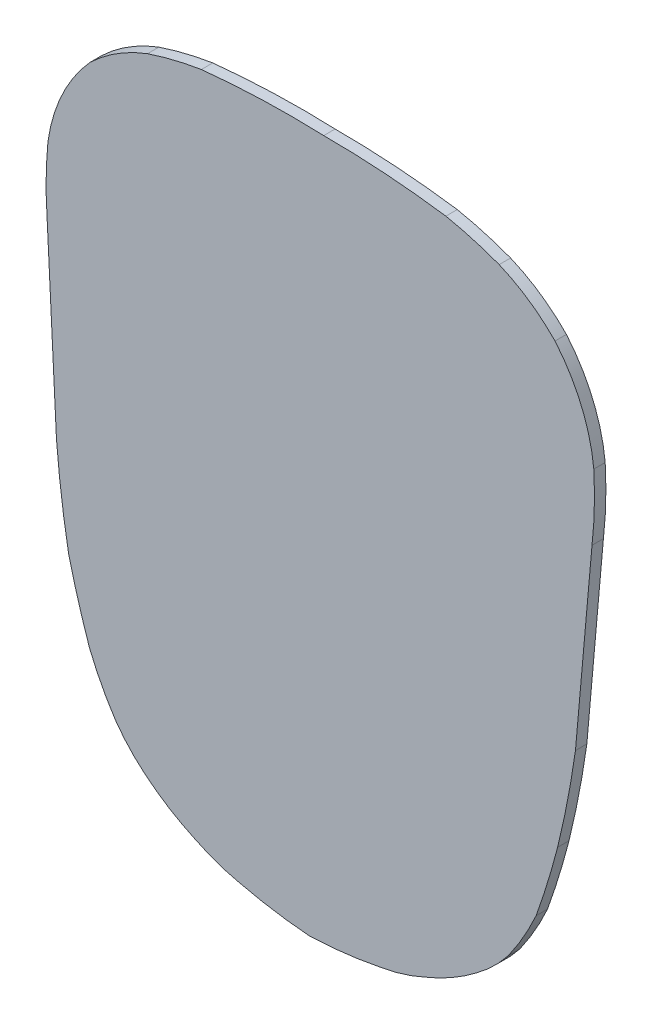
ISO-10303-21;
HEADER;
FILE_DESCRIPTION(('STEP AP214'),'2;1');
FILE_NAME('part.step','',(''),(''),'','','');
FILE_SCHEMA(('AUTOMOTIVE_DESIGN { 1 0 10303 214 1 1 1 1 }'));
ENDSEC;
DATA;
#1=APPLICATION_CONTEXT('core data for automotive mechanical design processes');
#2=APPLICATION_PROTOCOL_DEFINITION('international standard','automotive_design',2000,#1);
#3=PRODUCT_CONTEXT('',#1,'mechanical');
#4=PRODUCT('Part','Part','',(#3));
#5=PRODUCT_RELATED_PRODUCT_CATEGORY('part','',(#4));
#6=PRODUCT_DEFINITION_FORMATION('','',#4);
#7=PRODUCT_DEFINITION_CONTEXT('part definition',#1,'design');
#8=PRODUCT_DEFINITION('design','',#6,#7);
#9=PRODUCT_DEFINITION_SHAPE('','',#8);
#10=(LENGTH_UNIT() NAMED_UNIT(*) SI_UNIT(.MILLI.,.METRE.));
#11=(NAMED_UNIT(*) PLANE_ANGLE_UNIT() SI_UNIT($,.RADIAN.));
#12=(NAMED_UNIT(*) SI_UNIT($,.STERADIAN.) SOLID_ANGLE_UNIT());
#13=UNCERTAINTY_MEASURE_WITH_UNIT(LENGTH_MEASURE(1.E-05),#10,'distance_accuracy_value','');
#14=(GEOMETRIC_REPRESENTATION_CONTEXT(3) GLOBAL_UNCERTAINTY_ASSIGNED_CONTEXT((#13)) GLOBAL_UNIT_ASSIGNED_CONTEXT((#10,
#11,#12)) REPRESENTATION_CONTEXT('',''));
#15=CARTESIAN_POINT('',(0.,0.,0.));
#16=DIRECTION('',(0.,0.,1.));
#17=DIRECTION('',(1.,0.,0.));
#18=AXIS2_PLACEMENT_3D('',#15,#16,#17);
#19=CARTESIAN_POINT('',(-2.87645068487033,-22.2307778413904,43.1510965279302));
#20=DIRECTION('',(0.,0.,1.));
#21=DIRECTION('',(0.0193548335692301,0.999812677663925,0.));
#22=AXIS2_PLACEMENT_3D('',#19,#20,#21);
#23=PLANE('',#22);
#24=CARTESIAN_POINT('',(3.40605421210527,8.0200148488719,43.15109652793));
#25=DIRECTION('',(0.,0.,-1.));
#26=DIRECTION('',(-0.0193548335692301,-0.999812677663925,0.));
#27=AXIS2_PLACEMENT_3D('',#24,#25,#26);
#28=CIRCLE('',#27,7.43643173112);
#29=CARTESIAN_POINT('',(8.74976189327227,13.1916011731872,43.15109652793));
#30=VERTEX_POINT('',#29);
#31=CARTESIAN_POINT('',(6.29473617833653,14.8724621043842,43.1510965279299));
#32=VERTEX_POINT('',#31);
#33=EDGE_CURVE('E400',#30,#32,#28,.F.);
#34=ORIENTED_EDGE('',*,*,#33,.F.);
#35=CARTESIAN_POINT('',(3.11803650286176,8.43130453548574,43.1510965279299));
#36=DIRECTION('',(0.,0.,-1.));
#37=DIRECTION('',(-0.0193548335692301,-0.999812677663925,0.));
#38=AXIS2_PLACEMENT_3D('',#35,#36,#37);
#39=CIRCLE('',#38,7.3740595978);
#40=CARTESIAN_POINT('',(10.4553019723892,9.16702892789541,43.1510965279302));
#41=VERTEX_POINT('',#40);
#42=EDGE_CURVE('E194',#41,#30,#39,.F.);
#43=ORIENTED_EDGE('',*,*,#42,.F.);
#44=CARTESIAN_POINT('',(-6.32552371849111,8.14421174061843,43.1510965279296));
#45=DIRECTION('',(0.,0.,-1.));
#46=DIRECTION('',(-0.0193548335692301,-0.999812677663925,0.));
#47=AXIS2_PLACEMENT_3D('',#44,#45,#46);
#48=CIRCLE('',#47,16.81196793556);
#49=CARTESIAN_POINT('',(10.3766044314371,6.22557130278919,43.1510965279302));
#50=VERTEX_POINT('',#49);
#51=EDGE_CURVE('E20',#50,#41,#48,.F.);
#52=ORIENTED_EDGE('',*,*,#51,.F.);
#53=DIRECTION('',(-0.0886995040357044,-0.996058431008854,0.));
#54=VECTOR('',#53,1.);
#55=CARTESIAN_POINT('',(10.3766044314371,6.22557130278921,43.1510965279302));
#56=LINE('',#55,#54);
#57=CARTESIAN_POINT('',(9.64811099468465,-1.95510611475086,43.1510965279302));
#58=VERTEX_POINT('',#57);
#59=EDGE_CURVE('E193',#50,#58,#56,.T.);
#60=ORIENTED_EDGE('',*,*,#59,.T.);
#61=CARTESIAN_POINT('',(-31.2814474166913,3.80134354731974,43.1510965279289));
#62=DIRECTION('',(0.,0.,-1.));
#63=DIRECTION('',(-0.0193548335692301,-0.999812677663925,0.));
#64=AXIS2_PLACEMENT_3D('',#61,#62,#63);
#65=CIRCLE('',#64,41.33237791928);
#66=CARTESIAN_POINT('',(8.86403234955431,-6.0325732105216,43.1510965279303));
#67=VERTEX_POINT('',#66);
#68=EDGE_CURVE('E206',#67,#58,#65,.F.);
#69=ORIENTED_EDGE('',*,*,#68,.F.);
#70=CARTESIAN_POINT('',(-24.9737606237932,2.68335405814096,43.1510965279291));
#71=DIRECTION('',(0.,0.,-1.));
#72=DIRECTION('',(-0.0193548335692301,-0.999812677663925,0.));
#73=AXIS2_PLACEMENT_3D('',#70,#71,#72);
#74=CIRCLE('',#73,34.94228987144);
#75=CARTESIAN_POINT('',(7.9194767814797,-9.1064107597041,43.1510965279303));
#76=VERTEX_POINT('',#75);
#77=EDGE_CURVE('E320',#76,#67,#74,.F.);
#78=ORIENTED_EDGE('',*,*,#77,.F.);
#79=CARTESIAN_POINT('',(-3.58067037627316,-3.93497982202898,43.1510965279299));
#80=DIRECTION('',(0.,0.,-1.));
#81=DIRECTION('',(-0.0193548335692301,-0.999812677663925,0.));
#82=AXIS2_PLACEMENT_3D('',#79,#80,#81);
#83=CIRCLE('',#82,12.60940452968);
#84=CARTESIAN_POINT('',(6.69776683055133,-11.2391437836662,43.1510965279303));
#85=VERTEX_POINT('',#84);
#86=EDGE_CURVE('E324',#85,#76,#83,.F.);
#87=ORIENTED_EDGE('',*,*,#86,.F.);
#88=CARTESIAN_POINT('',(1.10266886694127,-6.86934474010801,43.15109652793));
#89=DIRECTION('',(0.,0.,-1.));
#90=DIRECTION('',(-0.0193548335692301,-0.999812677663925,0.));
#91=AXIS2_PLACEMENT_3D('',#88,#89,#90);
#92=CIRCLE('',#91,7.09931439672);
#93=CARTESIAN_POINT('',(5.3008399811585,-12.5943446701716,43.1510965279303));
#94=VERTEX_POINT('',#93);
#95=EDGE_CURVE('E328',#94,#85,#92,.F.);
#96=ORIENTED_EDGE('',*,*,#95,.F.);
#97=CARTESIAN_POINT('',(-0.638723059391969,-4.83953730632281,43.15109652793));
#98=DIRECTION('',(0.,0.,-1.));
#99=DIRECTION('',(-0.0193548335692301,-0.999812677663925,0.));
#100=AXIS2_PLACEMENT_3D('',#97,#98,#99);
#101=CIRCLE('',#100,9.76808304444);
#102=CARTESIAN_POINT('',(3.02325465351666,-13.8952187049386,43.1510965279302));
#103=VERTEX_POINT('',#102);
#104=EDGE_CURVE('E332',#103,#94,#101,.F.);
#105=ORIENTED_EDGE('',*,*,#104,.F.);
#106=CARTESIAN_POINT('',(-0.207770559998263,-6.83732878190931,43.15109652793));
#107=DIRECTION('',(0.,0.,-1.));
#108=DIRECTION('',(-0.0193548335692301,-0.999812677663925,0.));
#109=AXIS2_PLACEMENT_3D('',#106,#107,#108);
#110=CIRCLE('',#109,7.76230211316);
#111=CARTESIAN_POINT('',(1.11765382111094,-14.4856347581324,43.1510965279302));
#112=VERTEX_POINT('',#111);
#113=EDGE_CURVE('E336',#112,#103,#110,.F.);
#114=ORIENTED_EDGE('',*,*,#113,.F.);
#115=CARTESIAN_POINT('',(-2.80966912930602,4.75500909683415,43.1510965279298));
#116=DIRECTION('',(0.,0.,-1.));
#117=DIRECTION('',(-0.0193548335692301,-0.999812677663925,0.));
#118=AXIS2_PLACEMENT_3D('',#115,#116,#117);
#119=CIRCLE('',#118,19.6373684976);
#120=CARTESIAN_POINT('',(-2.0152683231092,-14.8662846645274,43.1510965279301));
#121=VERTEX_POINT('',#120);
#122=EDGE_CURVE('E340',#121,#112,#119,.F.);
#123=ORIENTED_EDGE('',*,*,#122,.F.);
#124=CARTESIAN_POINT('',(-0.523207579480698,4.71400533480683,43.1510965279299));
#125=DIRECTION('',(0.,0.,-1.));
#126=DIRECTION('',(-0.0193548335692301,-0.999812677663925,0.));
#127=AXIS2_PLACEMENT_3D('',#124,#125,#126);
#128=CIRCLE('',#127,19.63705684976);
#129=CARTESIAN_POINT('',(-5.17633782189568,-14.3637927736707,43.15109652793));
#130=VERTEX_POINT('',#129);
#131=EDGE_CURVE('E344',#130,#121,#128,.F.);
#132=ORIENTED_EDGE('',*,*,#131,.F.);
#133=CARTESIAN_POINT('',(-3.55589855490564,-6.77251418057686,43.1510965279299));
#134=DIRECTION('',(0.,0.,-1.));
#135=DIRECTION('',(-0.0193548335692301,-0.999812677663925,0.));
#136=AXIS2_PLACEMENT_3D('',#133,#134,#135);
#137=CIRCLE('',#136,7.76230211316);
#138=CARTESIAN_POINT('',(-7.05766041396093,-13.7000677154428,43.1510965279299));
#139=VERTEX_POINT('',#138);
#140=EDGE_CURVE('E348',#139,#130,#137,.F.);
#141=ORIENTED_EDGE('',*,*,#140,.F.);
#142=CARTESIAN_POINT('',(-3.04794957670783,-4.79289839153911,43.1510965279299));
#143=DIRECTION('',(0.,0.,-1.));
#144=DIRECTION('',(-0.0193548335692301,-0.999812677663925,0.));
#145=AXIS2_PLACEMENT_3D('',#142,#143,#144);
#146=CIRCLE('',#145,9.76808304444);
#147=CARTESIAN_POINT('',(-9.28319236302841,-12.3120202657152,43.1510965279298));
#148=VERTEX_POINT('',#147);
#149=EDGE_CURVE('E352',#148,#139,#146,.F.);
#150=ORIENTED_EDGE('',*,*,#149,.F.);
#151=CARTESIAN_POINT('',(-4.76167465689602,-6.83879977530856,43.1510965279299));
#152=DIRECTION('',(0.,0.,-1.));
#153=DIRECTION('',(-0.0193548335692301,-0.999812677663925,0.));
#154=AXIS2_PLACEMENT_3D('',#151,#152,#153);
#155=CIRCLE('',#154,7.09931439672);
#156=CARTESIAN_POINT('',(-10.5813963887555,-10.9046457963967,43.1510965279297));
#157=VERTEX_POINT('',#156);
#158=EDGE_CURVE('E356',#157,#148,#155,.F.);
#159=ORIENTED_EDGE('',*,*,#158,.F.);
#160=CARTESIAN_POINT('',(-0.0279711922389993,-4.00375460651079,43.15109652793));
#161=DIRECTION('',(0.,0.,-1.));
#162=DIRECTION('',(-0.0193548335692301,-0.999812677663925,0.));
#163=AXIS2_PLACEMENT_3D('',#160,#161,#162);
#164=CIRCLE('',#163,12.60940452968);
#165=CARTESIAN_POINT('',(-11.7196490905641,-8.726227530195,43.1510965279297));
#166=VERTEX_POINT('',#165);
#167=EDGE_CURVE('E360',#166,#157,#164,.F.);
#168=ORIENTED_EDGE('',*,*,#167,.F.);
#169=CARTESIAN_POINT('',(21.3074102324665,2.68328490166436,43.1510965279306));
#170=DIRECTION('',(0.,0.,-1.));
#171=DIRECTION('',(-0.0193548335692301,-0.999812677663925,0.));
#172=AXIS2_PLACEMENT_3D('',#169,#170,#171);
#173=CIRCLE('',#172,34.94228987144);
#174=CARTESIAN_POINT('',(-12.6348799299237,-5.61638738053107,43.1510965279296));
#175=VERTEX_POINT('',#174);
#176=EDGE_CURVE('E364',#175,#166,#173,.F.);
#177=ORIENTED_EDGE('',*,*,#176,.F.);
#178=CARTESIAN_POINT('',(28.0310735031442,1.7758853310058,43.1510965279308));
#179=DIRECTION('',(0.,0.,-1.));
#180=DIRECTION('',(-0.0193548335692301,-0.999812677663925,0.));
#181=AXIS2_PLACEMENT_3D('',#178,#179,#180);
#182=CIRCLE('',#181,41.33237791928);
#183=CARTESIAN_POINT('',(-13.1702154109104,-1.51337845938613,43.1510965279295));
#184=VERTEX_POINT('',#183);
#185=EDGE_CURVE('E368',#184,#175,#182,.F.);
#186=ORIENTED_EDGE('',*,*,#185,.F.);
#187=DIRECTION('',(-0.0500831809567766,0.998745050042928,0.));
#188=VECTOR('',#187,1.);
#189=CARTESIAN_POINT('',(-13.1702154109104,-1.51337845938573,43.1510965279295));
#190=LINE('',#189,#188);
#191=CARTESIAN_POINT('',(-13.5815510662261,6.68936429385884,43.1510965279294));
#192=VERTEX_POINT('',#191);
#193=EDGE_CURVE('E219',#184,#192,#190,.T.);
#194=ORIENTED_EDGE('',*,*,#193,.T.);
#195=CARTESIAN_POINT('',(3.18231954948565,7.96015453853935,43.1510965279299));
#196=DIRECTION('',(0.,0.,-1.));
#197=DIRECTION('',(-0.0193548335692301,-0.999812677663925,0.));
#198=AXIS2_PLACEMENT_3D('',#195,#196,#197);
#199=CIRCLE('',#198,16.81196793556);
#200=CARTESIAN_POINT('',(-13.5463481289567,9.63166390750378,43.1510965279294));
#201=VERTEX_POINT('',#200);
#202=EDGE_CURVE('E223',#201,#192,#199,.F.);
#203=ORIENTED_EDGE('',*,*,#202,.F.);
#204=CARTESIAN_POINT('',(-6.24305419079957,8.61252083374835,43.1510965279296));
#205=DIRECTION('',(0.,0.,-1.));
#206=DIRECTION('',(-0.0193548335692301,-0.999812677663925,0.));
#207=AXIS2_PLACEMENT_3D('',#204,#205,#206);
#208=CIRCLE('',#207,7.3740595978);
#209=CARTESIAN_POINT('',(-11.6863252040828,13.5872123445716,43.1510965279294));
#210=VERTEX_POINT('',#209);
#211=EDGE_CURVE('E376',#210,#201,#208,.F.);
#212=ORIENTED_EDGE('',*,*,#211,.F.);
#213=CARTESIAN_POINT('',(-6.54677401618405,8.21268627443511,43.1510965279296));
#214=DIRECTION('',(0.,0.,-1.));
#215=DIRECTION('',(-0.0193548335692301,-0.999812677663925,0.));
#216=AXIS2_PLACEMENT_3D('',#213,#214,#215);
#217=CIRCLE('',#216,7.43643173112);
#218=CARTESIAN_POINT('',(-9.16808546254474,15.17179851615,43.1510965279294));
#219=VERTEX_POINT('',#218);
#220=EDGE_CURVE('E380',#219,#210,#217,.F.);
#221=ORIENTED_EDGE('',*,*,#220,.F.);
#222=CARTESIAN_POINT('',(-4.43670572158524,1.02428534892838,43.1510965279298));
#223=DIRECTION('',(0.,0.,-1.));
#224=DIRECTION('',(-0.0193548335692301,-0.999812677663925,0.));
#225=AXIS2_PLACEMENT_3D('',#222,#223,#224);
#226=CIRCLE('',#225,14.91771038296);
#227=CARTESIAN_POINT('',(-6.80003650135285,15.7536013783737,43.1510965279295));
#228=VERTEX_POINT('',#227);
#229=EDGE_CURVE('E384',#228,#219,#226,.F.);
#230=ORIENTED_EDGE('',*,*,#229,.F.);
#231=CARTESIAN_POINT('',(-2.87645068487033,-22.2307778413904,43.1510965279302));
#232=DIRECTION('',(0.,0.,-1.));
#233=DIRECTION('',(-0.0193548335692301,-0.999812677663925,0.));
#234=AXIS2_PLACEMENT_3D('',#231,#232,#233);
#235=CIRCLE('',#234,38.18648439396);
#236=CARTESIAN_POINT('',(-1.41914055333825,15.9278887698879,43.1510965279297));
#237=VERTEX_POINT('',#236);
#238=EDGE_CURVE('E388',#237,#228,#235,.F.);
#239=ORIENTED_EDGE('',*,*,#238,.F.);
#240=CARTESIAN_POINT('',(-1.43975485684221,-22.2585901013477,43.1510965279302));
#241=DIRECTION('',(0.,0.,-1.));
#242=DIRECTION('',(-0.0193548335692301,-0.999812677663925,0.));
#243=AXIS2_PLACEMENT_3D('',#240,#241,#242);
#244=CIRCLE('',#243,38.186484435371);
#245=CARTESIAN_POINT('',(3.95097858118645,15.5454782846469,43.1510965279299));
#246=VERTEX_POINT('',#245);
#247=EDGE_CURVE('E392',#246,#237,#244,.F.);
#248=ORIENTED_EDGE('',*,*,#247,.F.);
#249=CARTESIAN_POINT('',(1.019358338455,0.918664351931352,43.15109652793));
#250=DIRECTION('',(0.,0.,-1.));
#251=DIRECTION('',(-0.0193548335692301,-0.999812677663925,0.));
#252=AXIS2_PLACEMENT_3D('',#249,#250,#251);
#253=CIRCLE('',#252,14.91771038296);
#254=EDGE_CURVE('E396',#32,#246,#253,.F.);
#255=ORIENTED_EDGE('',*,*,#254,.F.);
#256=EDGE_LOOP('',(#34,#43,#52,#60,#69,#78,#87,#96,#105,#114,#123,#132,#141,#150,#159,#168,#177,
#186,#194,#203,#212,#221,#230,#239,#248,#255));
#257=FACE_BOUND('',#256,.T.);
#258=ADVANCED_FACE('F17',(#257),#23,.F.);
#259=CARTESIAN_POINT('',(-6.32552371849112,8.14421174061844,43.5320965279296));
#260=DIRECTION('',(0.,0.,-1.));
#261=DIRECTION('',(-0.0193548335692301,-0.999812677663925,0.));
#262=AXIS2_PLACEMENT_3D('',#259,#260,#261);
#263=CYLINDRICAL_SURFACE('',#262,16.81196793556);
#264=DIRECTION('',(0.,0.,-1.));
#265=VECTOR('',#264,1.);
#266=CARTESIAN_POINT('',(10.4553019723892,9.16702892789546,43.5320965279302));
#267=LINE('',#266,#265);
#268=CARTESIAN_POINT('',(10.4553019723892,9.16702892789545,43.6520965279302));
#269=VERTEX_POINT('',#268);
#270=EDGE_CURVE('E198',#269,#41,#267,.T.);
#271=ORIENTED_EDGE('',*,*,#270,.F.);
#272=CARTESIAN_POINT('',(-6.32552371849113,8.14421174061844,43.6520965279296));
#273=DIRECTION('',(0.,0.,-1.));
#274=DIRECTION('',(-0.0193548335692301,-0.999812677663925,0.));
#275=AXIS2_PLACEMENT_3D('',#272,#273,#274);
#276=CIRCLE('',#275,16.81196793556);
#277=CARTESIAN_POINT('',(10.3766044314371,6.22557130278932,43.6520965279302));
#278=VERTEX_POINT('',#277);
#279=EDGE_CURVE('E203',#278,#269,#276,.F.);
#280=ORIENTED_EDGE('',*,*,#279,.F.);
#281=DIRECTION('',(0.,0.,1.));
#282=VECTOR('',#281,1.);
#283=CARTESIAN_POINT('',(10.3766044314371,6.22557130278923,43.5320965279302));
#284=LINE('',#283,#282);
#285=EDGE_CURVE('E200',#278,#50,#284,.F.);
#286=ORIENTED_EDGE('',*,*,#285,.T.);
#287=ORIENTED_EDGE('',*,*,#51,.T.);
#288=EDGE_LOOP('',(#271,#280,#286,#287));
#289=FACE_BOUND('',#288,.T.);
#290=ADVANCED_FACE('F201',(#289),#263,.T.);
#291=CARTESIAN_POINT('',(3.11803650286175,8.43130453548575,43.5320965279299));
#292=DIRECTION('',(0.,0.,-1.));
#293=DIRECTION('',(-0.0193548335692301,-0.999812677663925,0.));
#294=AXIS2_PLACEMENT_3D('',#291,#292,#293);
#295=CYLINDRICAL_SURFACE('',#294,7.3740595978);
#296=DIRECTION('',(0.,0.,-1.));
#297=VECTOR('',#296,1.);
#298=CARTESIAN_POINT('',(8.74976189327226,13.1916011731872,43.53209652793));
#299=LINE('',#298,#297);
#300=CARTESIAN_POINT('',(8.74976189327226,13.1916011731872,43.65209652793));
#301=VERTEX_POINT('',#300);
#302=EDGE_CURVE('E402',#301,#30,#299,.T.);
#303=ORIENTED_EDGE('',*,*,#302,.F.);
#304=CARTESIAN_POINT('',(3.11803650286175,8.43130453548575,43.6520965279299));
#305=DIRECTION('',(0.,0.,-1.));
#306=DIRECTION('',(-0.0193548335692301,-0.999812677663925,0.));
#307=AXIS2_PLACEMENT_3D('',#304,#305,#306);
#308=CIRCLE('',#307,7.3740595978);
#309=EDGE_CURVE('E311',#269,#301,#308,.F.);
#310=ORIENTED_EDGE('',*,*,#309,.F.);
#311=ORIENTED_EDGE('',*,*,#270,.T.);
#312=ORIENTED_EDGE('',*,*,#42,.T.);
#313=EDGE_LOOP('',(#303,#310,#311,#312));
#314=FACE_BOUND('',#313,.T.);
#315=ADVANCED_FACE('F410',(#314),#295,.T.);
#316=CARTESIAN_POINT('',(3.40605421210526,8.02001484887191,43.53209652793));
#317=DIRECTION('',(0.,0.,-1.));
#318=DIRECTION('',(-0.0193548335692301,-0.999812677663925,0.));
#319=AXIS2_PLACEMENT_3D('',#316,#317,#318);
#320=CYLINDRICAL_SURFACE('',#319,7.43643173112);
#321=DIRECTION('',(0.,0.,-1.));
#322=VECTOR('',#321,1.);
#323=CARTESIAN_POINT('',(6.29473617833652,14.8724621043842,43.5320965279299));
#324=LINE('',#323,#322);
#325=CARTESIAN_POINT('',(6.29473617833651,14.8724621043842,43.6520965279299));
#326=VERTEX_POINT('',#325);
#327=EDGE_CURVE('E399',#326,#32,#324,.T.);
#328=ORIENTED_EDGE('',*,*,#327,.F.);
#329=CARTESIAN_POINT('',(3.40605421210526,8.02001484887191,43.6520965279299));
#330=DIRECTION('',(0.,0.,-1.));
#331=DIRECTION('',(-0.0193548335692301,-0.999812677663925,0.));
#332=AXIS2_PLACEMENT_3D('',#329,#330,#331);
#333=CIRCLE('',#332,7.43643173112);
#334=EDGE_CURVE('E307',#301,#326,#333,.F.);
#335=ORIENTED_EDGE('',*,*,#334,.F.);
#336=ORIENTED_EDGE('',*,*,#302,.T.);
#337=ORIENTED_EDGE('',*,*,#33,.T.);
#338=EDGE_LOOP('',(#328,#335,#336,#337));
#339=FACE_BOUND('',#338,.T.);
#340=ADVANCED_FACE('F486',(#339),#320,.T.);
#341=CARTESIAN_POINT('',(1.01935833845499,0.918664351931359,43.53209652793));
#342=DIRECTION('',(0.,0.,-1.));
#343=DIRECTION('',(-0.0193548335692301,-0.999812677663925,0.));
#344=AXIS2_PLACEMENT_3D('',#341,#342,#343);
#345=CYLINDRICAL_SURFACE('',#344,14.91771038296);
#346=DIRECTION('',(0.,0.,-1.));
#347=VECTOR('',#346,1.);
#348=CARTESIAN_POINT('',(3.95097858118647,15.5454782846469,43.5320965279299));
#349=LINE('',#348,#347);
#350=CARTESIAN_POINT('',(3.95097858118645,15.5454782846469,43.6520965279299));
#351=VERTEX_POINT('',#350);
#352=EDGE_CURVE('E395',#351,#246,#349,.T.);
#353=ORIENTED_EDGE('',*,*,#352,.F.);
#354=CARTESIAN_POINT('',(1.01935833845498,0.91866435193136,43.6520965279299));
#355=DIRECTION('',(0.,0.,-1.));
#356=DIRECTION('',(-0.0193548335692301,-0.999812677663925,0.));
#357=AXIS2_PLACEMENT_3D('',#354,#355,#356);
#358=CIRCLE('',#357,14.91771038296);
#359=EDGE_CURVE('E303',#326,#351,#358,.F.);
#360=ORIENTED_EDGE('',*,*,#359,.F.);
#361=ORIENTED_EDGE('',*,*,#327,.T.);
#362=ORIENTED_EDGE('',*,*,#254,.T.);
#363=EDGE_LOOP('',(#353,#360,#361,#362));
#364=FACE_BOUND('',#363,.T.);
#365=ADVANCED_FACE('F482',(#364),#345,.T.);
#366=CARTESIAN_POINT('',(-1.43975485684222,-22.2585901013477,43.5320965279302));
#367=DIRECTION('',(0.,0.,-1.));
#368=DIRECTION('',(-0.0193548335692301,-0.999812677663925,0.));
#369=AXIS2_PLACEMENT_3D('',#366,#367,#368);
#370=CYLINDRICAL_SURFACE('',#369,38.186484435371);
#371=DIRECTION('',(0.,0.,-1.));
#372=VECTOR('',#371,1.);
#373=CARTESIAN_POINT('',(-1.41914055333816,15.9278887698879,43.5320965279297));
#374=LINE('',#373,#372);
#375=CARTESIAN_POINT('',(-1.41914055333827,15.9278887698879,43.6520965279297));
#376=VERTEX_POINT('',#375);
#377=EDGE_CURVE('E391',#376,#237,#374,.T.);
#378=ORIENTED_EDGE('',*,*,#377,.F.);
#379=CARTESIAN_POINT('',(-1.43975485684222,-22.2585901013477,43.6520965279302));
#380=DIRECTION('',(0.,0.,-1.));
#381=DIRECTION('',(-0.0193548335692301,-0.999812677663925,0.));
#382=AXIS2_PLACEMENT_3D('',#379,#380,#381);
#383=CIRCLE('',#382,38.186484435371);
#384=EDGE_CURVE('E300',#351,#376,#383,.F.);
#385=ORIENTED_EDGE('',*,*,#384,.F.);
#386=ORIENTED_EDGE('',*,*,#352,.T.);
#387=ORIENTED_EDGE('',*,*,#247,.T.);
#388=EDGE_LOOP('',(#378,#385,#386,#387));
#389=FACE_BOUND('',#388,.T.);
#390=ADVANCED_FACE('F491',(#389),#370,.T.);
#391=CARTESIAN_POINT('',(-2.87645068487034,-22.2307778413904,43.5320965279302));
#392=DIRECTION('',(0.,0.,-1.));
#393=DIRECTION('',(-0.0193548335692301,-0.999812677663925,0.));
#394=AXIS2_PLACEMENT_3D('',#391,#392,#393);
#395=CYLINDRICAL_SURFACE('',#394,38.18648439396);
#396=DIRECTION('',(0.,0.,-1.));
#397=VECTOR('',#396,1.);
#398=CARTESIAN_POINT('',(-6.80003650135287,15.7536013783737,43.5320965279295));
#399=LINE('',#398,#397);
#400=CARTESIAN_POINT('',(-6.80003650135289,15.7536013783737,43.6520965279295));
#401=VERTEX_POINT('',#400);
#402=EDGE_CURVE('E387',#401,#228,#399,.T.);
#403=ORIENTED_EDGE('',*,*,#402,.F.);
#404=CARTESIAN_POINT('',(-2.87645068487035,-22.2307778413904,43.6520965279302));
#405=DIRECTION('',(0.,0.,-1.));
#406=DIRECTION('',(-0.0193548335692301,-0.999812677663925,0.));
#407=AXIS2_PLACEMENT_3D('',#404,#405,#406);
#408=CIRCLE('',#407,38.18648439396);
#409=EDGE_CURVE('E296',#376,#401,#408,.F.);
#410=ORIENTED_EDGE('',*,*,#409,.F.);
#411=ORIENTED_EDGE('',*,*,#377,.T.);
#412=ORIENTED_EDGE('',*,*,#238,.T.);
#413=EDGE_LOOP('',(#403,#410,#411,#412));
#414=FACE_BOUND('',#413,.T.);
#415=ADVANCED_FACE('F495',(#414),#395,.T.);
#416=CARTESIAN_POINT('',(-4.43670572158525,1.02428534892838,43.5320965279298));
#417=DIRECTION('',(0.,0.,-1.));
#418=DIRECTION('',(-0.0193548335692301,-0.999812677663925,0.));
#419=AXIS2_PLACEMENT_3D('',#416,#417,#418);
#420=CYLINDRICAL_SURFACE('',#419,14.91771038296);
#421=DIRECTION('',(0.,0.,-1.));
#422=VECTOR('',#421,1.);
#423=CARTESIAN_POINT('',(-9.16808546254472,15.17179851615,43.5320965279294));
#424=LINE('',#423,#422);
#425=CARTESIAN_POINT('',(-9.16808546254475,15.17179851615,43.6520965279295));
#426=VERTEX_POINT('',#425);
#427=EDGE_CURVE('E383',#426,#219,#424,.T.);
#428=ORIENTED_EDGE('',*,*,#427,.F.);
#429=CARTESIAN_POINT('',(-4.43670572158526,1.02428534892839,43.6520965279298));
#430=DIRECTION('',(0.,0.,-1.));
#431=DIRECTION('',(-0.0193548335692301,-0.999812677663925,0.));
#432=AXIS2_PLACEMENT_3D('',#429,#430,#431);
#433=CIRCLE('',#432,14.91771038296);
#434=EDGE_CURVE('E292',#401,#426,#433,.F.);
#435=ORIENTED_EDGE('',*,*,#434,.F.);
#436=ORIENTED_EDGE('',*,*,#402,.T.);
#437=ORIENTED_EDGE('',*,*,#229,.T.);
#438=EDGE_LOOP('',(#428,#435,#436,#437));
#439=FACE_BOUND('',#438,.T.);
#440=ADVANCED_FACE('F497',(#439),#420,.T.);
#441=CARTESIAN_POINT('',(-6.54677401618406,8.21268627443511,43.5320965279296));
#442=DIRECTION('',(0.,0.,-1.));
#443=DIRECTION('',(-0.0193548335692301,-0.999812677663925,0.));
#444=AXIS2_PLACEMENT_3D('',#441,#442,#443);
#445=CYLINDRICAL_SURFACE('',#444,7.43643173112);
#446=DIRECTION('',(0.,0.,-1.));
#447=VECTOR('',#446,1.);
#448=CARTESIAN_POINT('',(-11.6863252040828,13.5872123445716,43.5320965279294));
#449=LINE('',#448,#447);
#450=CARTESIAN_POINT('',(-11.6863252040828,13.5872123445716,43.6520965279294));
#451=VERTEX_POINT('',#450);
#452=EDGE_CURVE('E379',#451,#210,#449,.T.);
#453=ORIENTED_EDGE('',*,*,#452,.F.);
#454=CARTESIAN_POINT('',(-6.54677401618406,8.21268627443511,43.6520965279296));
#455=DIRECTION('',(0.,0.,-1.));
#456=DIRECTION('',(-0.0193548335692301,-0.999812677663925,0.));
#457=AXIS2_PLACEMENT_3D('',#454,#455,#456);
#458=CIRCLE('',#457,7.43643173112);
#459=EDGE_CURVE('E288',#426,#451,#458,.F.);
#460=ORIENTED_EDGE('',*,*,#459,.F.);
#461=ORIENTED_EDGE('',*,*,#427,.T.);
#462=ORIENTED_EDGE('',*,*,#220,.T.);
#463=EDGE_LOOP('',(#453,#460,#461,#462));
#464=FACE_BOUND('',#463,.T.);
#465=ADVANCED_FACE('F501',(#464),#445,.T.);
#466=CARTESIAN_POINT('',(-6.24305419079959,8.61252083374836,43.5320965279296));
#467=DIRECTION('',(0.,0.,-1.));
#468=DIRECTION('',(-0.0193548335692301,-0.999812677663925,0.));
#469=AXIS2_PLACEMENT_3D('',#466,#467,#468);
#470=CYLINDRICAL_SURFACE('',#469,7.3740595978);
#471=DIRECTION('',(0.,0.,-1.));
#472=VECTOR('',#471,1.);
#473=CARTESIAN_POINT('',(-13.5463481289567,9.63166390750379,43.5320965279294));
#474=LINE('',#473,#472);
#475=CARTESIAN_POINT('',(-13.5463481289567,9.63166390750378,43.6520965279294));
#476=VERTEX_POINT('',#475);
#477=EDGE_CURVE('E375',#476,#201,#474,.T.);
#478=ORIENTED_EDGE('',*,*,#477,.F.);
#479=CARTESIAN_POINT('',(-6.24305419079959,8.61252083374836,43.6520965279296));
#480=DIRECTION('',(0.,0.,-1.));
#481=DIRECTION('',(-0.0193548335692301,-0.999812677663925,0.));
#482=AXIS2_PLACEMENT_3D('',#479,#480,#481);
#483=CIRCLE('',#482,7.3740595978);
#484=EDGE_CURVE('E284',#451,#476,#483,.F.);
#485=ORIENTED_EDGE('',*,*,#484,.F.);
#486=ORIENTED_EDGE('',*,*,#452,.T.);
#487=ORIENTED_EDGE('',*,*,#211,.T.);
#488=EDGE_LOOP('',(#478,#485,#486,#487));
#489=FACE_BOUND('',#488,.T.);
#490=ADVANCED_FACE('F506',(#489),#470,.T.);
#491=CARTESIAN_POINT('',(3.18231954948564,7.96015453853935,43.5320965279299));
#492=DIRECTION('',(0.,0.,-1.));
#493=DIRECTION('',(-0.0193548335692301,-0.999812677663925,0.));
#494=AXIS2_PLACEMENT_3D('',#491,#492,#493);
#495=CYLINDRICAL_SURFACE('',#494,16.81196793556);
#496=DIRECTION('',(0.,0.,1.));
#497=VECTOR('',#496,1.);
#498=CARTESIAN_POINT('',(-13.5815510662261,6.68936429385887,43.5320965279294));
#499=LINE('',#498,#497);
#500=CARTESIAN_POINT('',(-13.5815510662261,6.68936429385886,43.6520965279294));
#501=VERTEX_POINT('',#500);
#502=EDGE_CURVE('E222',#192,#501,#499,.T.);
#503=ORIENTED_EDGE('',*,*,#502,.T.);
#504=CARTESIAN_POINT('',(3.18231954948563,7.96015453853936,43.6520965279299));
#505=DIRECTION('',(0.,0.,-1.));
#506=DIRECTION('',(-0.0193548335692301,-0.999812677663925,0.));
#507=AXIS2_PLACEMENT_3D('',#504,#505,#506);
#508=CIRCLE('',#507,16.81196793556);
#509=EDGE_CURVE('E280',#476,#501,#508,.F.);
#510=ORIENTED_EDGE('',*,*,#509,.F.);
#511=ORIENTED_EDGE('',*,*,#477,.T.);
#512=ORIENTED_EDGE('',*,*,#202,.T.);
#513=EDGE_LOOP('',(#503,#510,#511,#512));
#514=FACE_BOUND('',#513,.T.);
#515=ADVANCED_FACE('F510',(#514),#495,.T.);
#516=CARTESIAN_POINT('',(-13.1702154109105,-1.51337845938573,43.5320965279295));
#517=DIRECTION('',(0.998745050042928,0.0500831809567766,0.));
#518=DIRECTION('',(-0.0500831809567766,0.998745050042928,0.));
#519=AXIS2_PLACEMENT_3D('',#516,#517,#518);
#520=PLANE('',#519);
#521=ORIENTED_EDGE('',*,*,#502,.F.);
#522=ORIENTED_EDGE('',*,*,#193,.F.);
#523=DIRECTION('',(0.,0.,-1.));
#524=VECTOR('',#523,1.);
#525=CARTESIAN_POINT('',(-13.1702154109104,-1.51337845938593,43.5320965279295));
#526=LINE('',#525,#524);
#527=CARTESIAN_POINT('',(-13.1702154109104,-1.51337845938599,43.6520965279296));
#528=VERTEX_POINT('',#527);
#529=EDGE_CURVE('E371',#528,#184,#526,.T.);
#530=ORIENTED_EDGE('',*,*,#529,.F.);
#531=DIRECTION('',(0.050083180956776,-0.998745050042928,0.));
#532=VECTOR('',#531,1.);
#533=CARTESIAN_POINT('',(-13.5815510662261,6.68936429385881,43.6520965279294));
#534=LINE('',#533,#532);
#535=EDGE_CURVE('E279',#501,#528,#534,.T.);
#536=ORIENTED_EDGE('',*,*,#535,.F.);
#537=EDGE_LOOP('',(#521,#522,#530,#536));
#538=FACE_BOUND('',#537,.T.);
#539=ADVANCED_FACE('F514',(#538),#520,.F.);
#540=CARTESIAN_POINT('',(28.0310735031442,1.77588533100581,43.5320965279308));
#541=DIRECTION('',(0.,0.,-1.));
#542=DIRECTION('',(-0.0193548335692301,-0.999812677663925,0.));
#543=AXIS2_PLACEMENT_3D('',#540,#541,#542);
#544=CYLINDRICAL_SURFACE('',#543,41.33237791928);
#545=DIRECTION('',(0.,0.,-1.));
#546=VECTOR('',#545,1.);
#547=CARTESIAN_POINT('',(-12.6348799299237,-5.61638738053115,43.5320965279296));
#548=LINE('',#547,#546);
#549=CARTESIAN_POINT('',(-12.6348799299238,-5.61638738053106,43.6520965279296));
#550=VERTEX_POINT('',#549);
#551=EDGE_CURVE('E367',#550,#175,#548,.T.);
#552=ORIENTED_EDGE('',*,*,#551,.F.);
#553=CARTESIAN_POINT('',(28.0310735031442,1.77588533100581,43.6520965279308));
#554=DIRECTION('',(0.,0.,-1.));
#555=DIRECTION('',(-0.0193548335692301,-0.999812677663925,0.));
#556=AXIS2_PLACEMENT_3D('',#553,#554,#555);
#557=CIRCLE('',#556,41.33237791928);
#558=EDGE_CURVE('E275',#528,#550,#557,.F.);
#559=ORIENTED_EDGE('',*,*,#558,.F.);
#560=ORIENTED_EDGE('',*,*,#529,.T.);
#561=ORIENTED_EDGE('',*,*,#185,.T.);
#562=EDGE_LOOP('',(#552,#559,#560,#561));
#563=FACE_BOUND('',#562,.T.);
#564=ADVANCED_FACE('F522',(#563),#544,.T.);
#565=CARTESIAN_POINT('',(21.3074102324665,2.68328490166436,43.5320965279306));
#566=DIRECTION('',(0.,0.,-1.));
#567=DIRECTION('',(-0.0193548335692301,-0.999812677663925,0.));
#568=AXIS2_PLACEMENT_3D('',#565,#566,#567);
#569=CYLINDRICAL_SURFACE('',#568,34.94228987144);
#570=DIRECTION('',(0.,0.,-1.));
#571=VECTOR('',#570,1.);
#572=CARTESIAN_POINT('',(-11.7196490905641,-8.72622753019495,43.5320965279297));
#573=LINE('',#572,#571);
#574=CARTESIAN_POINT('',(-11.7196490905641,-8.72622753019496,43.6520965279297));
#575=VERTEX_POINT('',#574);
#576=EDGE_CURVE('E363',#575,#166,#573,.T.);
#577=ORIENTED_EDGE('',*,*,#576,.F.);
#578=CARTESIAN_POINT('',(21.3074102324665,2.68328490166437,43.6520965279306));
#579=DIRECTION('',(0.,0.,-1.));
#580=DIRECTION('',(-0.0193548335692301,-0.999812677663925,0.));
#581=AXIS2_PLACEMENT_3D('',#578,#579,#580);
#582=CIRCLE('',#581,34.94228987144);
#583=EDGE_CURVE('E271',#550,#575,#582,.F.);
#584=ORIENTED_EDGE('',*,*,#583,.F.);
#585=ORIENTED_EDGE('',*,*,#551,.T.);
#586=ORIENTED_EDGE('',*,*,#176,.T.);
#587=EDGE_LOOP('',(#577,#584,#585,#586));
#588=FACE_BOUND('',#587,.T.);
#589=ADVANCED_FACE('F526',(#588),#569,.T.);
#590=CARTESIAN_POINT('',(-0.0279711922390115,-4.00375460651078,43.53209652793));
#591=DIRECTION('',(0.,0.,-1.));
#592=DIRECTION('',(-0.0193548335692301,-0.999812677663925,0.));
#593=AXIS2_PLACEMENT_3D('',#590,#591,#592);
#594=CYLINDRICAL_SURFACE('',#593,12.60940452968);
#595=DIRECTION('',(0.,0.,-1.));
#596=VECTOR('',#595,1.);
#597=CARTESIAN_POINT('',(-10.5813963887555,-10.9046457963967,43.5320965279297));
#598=LINE('',#597,#596);
#599=CARTESIAN_POINT('',(-10.5813963887555,-10.9046457963967,43.6520965279297));
#600=VERTEX_POINT('',#599);
#601=EDGE_CURVE('E359',#600,#157,#598,.T.);
#602=ORIENTED_EDGE('',*,*,#601,.F.);
#603=CARTESIAN_POINT('',(-0.0279711922390154,-4.00375460651078,43.65209652793));
#604=DIRECTION('',(0.,0.,-1.));
#605=DIRECTION('',(-0.0193548335692301,-0.999812677663925,0.));
#606=AXIS2_PLACEMENT_3D('',#603,#604,#605);
#607=CIRCLE('',#606,12.60940452968);
#608=EDGE_CURVE('E267',#575,#600,#607,.F.);
#609=ORIENTED_EDGE('',*,*,#608,.F.);
#610=ORIENTED_EDGE('',*,*,#576,.T.);
#611=ORIENTED_EDGE('',*,*,#167,.T.);
#612=EDGE_LOOP('',(#602,#609,#610,#611));
#613=FACE_BOUND('',#612,.T.);
#614=ADVANCED_FACE('F530',(#613),#594,.T.);
#615=CARTESIAN_POINT('',(-4.76167465689604,-6.83879977530855,43.5320965279299));
#616=DIRECTION('',(0.,0.,-1.));
#617=DIRECTION('',(-0.0193548335692301,-0.999812677663925,0.));
#618=AXIS2_PLACEMENT_3D('',#615,#616,#617);
#619=CYLINDRICAL_SURFACE('',#618,7.09931439672);
#620=DIRECTION('',(0.,0.,-1.));
#621=VECTOR('',#620,1.);
#622=CARTESIAN_POINT('',(-9.28319236302909,-12.3120202657146,43.5320965279298));
#623=LINE('',#622,#621);
#624=CARTESIAN_POINT('',(-9.28319236302837,-12.3120202657152,43.6520965279298));
#625=VERTEX_POINT('',#624);
#626=EDGE_CURVE('E355',#625,#148,#623,.T.);
#627=ORIENTED_EDGE('',*,*,#626,.F.);
#628=CARTESIAN_POINT('',(-4.76167465689604,-6.83879977530855,43.6520965279299));
#629=DIRECTION('',(0.,0.,-1.));
#630=DIRECTION('',(-0.0193548335692301,-0.999812677663925,0.));
#631=AXIS2_PLACEMENT_3D('',#628,#629,#630);
#632=CIRCLE('',#631,7.09931439672);
#633=EDGE_CURVE('E263',#600,#625,#632,.F.);
#634=ORIENTED_EDGE('',*,*,#633,.F.);
#635=ORIENTED_EDGE('',*,*,#601,.T.);
#636=ORIENTED_EDGE('',*,*,#158,.T.);
#637=EDGE_LOOP('',(#627,#634,#635,#636));
#638=FACE_BOUND('',#637,.T.);
#639=ADVANCED_FACE('F534',(#638),#619,.T.);
#640=CARTESIAN_POINT('',(-3.04794957670783,-4.79289839153911,43.5320965279299));
#641=DIRECTION('',(0.,0.,-1.));
#642=DIRECTION('',(-0.0193548335692301,-0.999812677663925,0.));
#643=AXIS2_PLACEMENT_3D('',#640,#641,#642);
#644=CYLINDRICAL_SURFACE('',#643,9.76808304444);
#645=DIRECTION('',(0.,0.,-1.));
#646=VECTOR('',#645,1.);
#647=CARTESIAN_POINT('',(-7.05766041396094,-13.7000677154428,43.5320965279299));
#648=LINE('',#647,#646);
#649=CARTESIAN_POINT('',(-7.05766041396095,-13.7000677154428,43.6520965279299));
#650=VERTEX_POINT('',#649);
#651=EDGE_CURVE('E351',#650,#139,#648,.T.);
#652=ORIENTED_EDGE('',*,*,#651,.F.);
#653=CARTESIAN_POINT('',(-3.04794957670784,-4.7928983915391,43.6520965279299));
#654=DIRECTION('',(0.,0.,-1.));
#655=DIRECTION('',(-0.0193548335692301,-0.999812677663925,0.));
#656=AXIS2_PLACEMENT_3D('',#653,#654,#655);
#657=CIRCLE('',#656,9.76808304444);
#658=EDGE_CURVE('E259',#625,#650,#657,.F.);
#659=ORIENTED_EDGE('',*,*,#658,.F.);
#660=ORIENTED_EDGE('',*,*,#626,.T.);
#661=ORIENTED_EDGE('',*,*,#149,.T.);
#662=EDGE_LOOP('',(#652,#659,#660,#661));
#663=FACE_BOUND('',#662,.T.);
#664=ADVANCED_FACE('F538',(#663),#644,.T.);
#665=CARTESIAN_POINT('',(-3.55589855490565,-6.77251418057685,43.5320965279299));
#666=DIRECTION('',(0.,0.,-1.));
#667=DIRECTION('',(-0.0193548335692301,-0.999812677663925,0.));
#668=AXIS2_PLACEMENT_3D('',#665,#666,#667);
#669=CYLINDRICAL_SURFACE('',#668,7.76230211316);
#670=DIRECTION('',(0.,0.,-1.));
#671=VECTOR('',#670,1.);
#672=CARTESIAN_POINT('',(-5.17633782189566,-14.3637927736707,43.53209652793));
#673=LINE('',#672,#671);
#674=CARTESIAN_POINT('',(-5.17633782189564,-14.3637927736707,43.6520965279299));
#675=VERTEX_POINT('',#674);
#676=EDGE_CURVE('E347',#675,#130,#673,.T.);
#677=ORIENTED_EDGE('',*,*,#676,.F.);
#678=CARTESIAN_POINT('',(-3.55589855490566,-6.77251418057685,43.6520965279299));
#679=DIRECTION('',(0.,0.,-1.));
#680=DIRECTION('',(-0.0193548335692301,-0.999812677663925,0.));
#681=AXIS2_PLACEMENT_3D('',#678,#679,#680);
#682=CIRCLE('',#681,7.76230211316);
#683=EDGE_CURVE('E255',#650,#675,#682,.F.);
#684=ORIENTED_EDGE('',*,*,#683,.F.);
#685=ORIENTED_EDGE('',*,*,#651,.T.);
#686=ORIENTED_EDGE('',*,*,#140,.T.);
#687=EDGE_LOOP('',(#677,#684,#685,#686));
#688=FACE_BOUND('',#687,.T.);
#689=ADVANCED_FACE('F542',(#688),#669,.T.);
#690=CARTESIAN_POINT('',(-0.52320757948071,4.71400533480683,43.5320965279299));
#691=DIRECTION('',(0.,0.,-1.));
#692=DIRECTION('',(-0.0193548335692301,-0.999812677663925,0.));
#693=AXIS2_PLACEMENT_3D('',#690,#691,#692);
#694=CYLINDRICAL_SURFACE('',#693,19.63705684976);
#695=DIRECTION('',(0.,0.,-1.));
#696=VECTOR('',#695,1.);
#697=CARTESIAN_POINT('',(-2.01526832310921,-14.8662846645274,43.5320965279301));
#698=LINE('',#697,#696);
#699=CARTESIAN_POINT('',(-2.01526832310922,-14.8662846645274,43.6520965279301));
#700=VERTEX_POINT('',#699);
#701=EDGE_CURVE('E343',#700,#121,#698,.T.);
#702=ORIENTED_EDGE('',*,*,#701,.F.);
#703=CARTESIAN_POINT('',(-0.523207579480714,4.71400533480683,43.6520965279299));
#704=DIRECTION('',(0.,0.,-1.));
#705=DIRECTION('',(-0.0193548335692301,-0.999812677663925,0.));
#706=AXIS2_PLACEMENT_3D('',#703,#704,#705);
#707=CIRCLE('',#706,19.63705684976);
#708=EDGE_CURVE('E251',#675,#700,#707,.F.);
#709=ORIENTED_EDGE('',*,*,#708,.F.);
#710=ORIENTED_EDGE('',*,*,#676,.T.);
#711=ORIENTED_EDGE('',*,*,#131,.T.);
#712=EDGE_LOOP('',(#702,#709,#710,#711));
#713=FACE_BOUND('',#712,.T.);
#714=ADVANCED_FACE('F546',(#713),#694,.T.);
#715=CARTESIAN_POINT('',(-2.80966912930603,4.75500909683415,43.5320965279298));
#716=DIRECTION('',(0.,0.,-1.));
#717=DIRECTION('',(-0.0193548335692301,-0.999812677663925,0.));
#718=AXIS2_PLACEMENT_3D('',#715,#716,#717);
#719=CYLINDRICAL_SURFACE('',#718,19.6373684976);
#720=DIRECTION('',(0.,0.,-1.));
#721=VECTOR('',#720,1.);
#722=CARTESIAN_POINT('',(1.11765382111095,-14.4856347581324,43.5320965279302));
#723=LINE('',#722,#721);
#724=CARTESIAN_POINT('',(1.11765382111094,-14.4856347581324,43.6520965279302));
#725=VERTEX_POINT('',#724);
#726=EDGE_CURVE('E339',#725,#112,#723,.T.);
#727=ORIENTED_EDGE('',*,*,#726,.F.);
#728=CARTESIAN_POINT('',(-2.80966912930604,4.75500909683415,43.6520965279298));
#729=DIRECTION('',(0.,0.,-1.));
#730=DIRECTION('',(-0.0193548335692301,-0.999812677663925,0.));
#731=AXIS2_PLACEMENT_3D('',#728,#729,#730);
#732=CIRCLE('',#731,19.6373684976);
#733=EDGE_CURVE('E247',#700,#725,#732,.F.);
#734=ORIENTED_EDGE('',*,*,#733,.F.);
#735=ORIENTED_EDGE('',*,*,#701,.T.);
#736=ORIENTED_EDGE('',*,*,#122,.T.);
#737=EDGE_LOOP('',(#727,#734,#735,#736));
#738=FACE_BOUND('',#737,.T.);
#739=ADVANCED_FACE('F550',(#738),#719,.T.);
#740=CARTESIAN_POINT('',(-0.207770559998276,-6.8373287819093,43.53209652793));
#741=DIRECTION('',(0.,0.,-1.));
#742=DIRECTION('',(-0.0193548335692301,-0.999812677663925,0.));
#743=AXIS2_PLACEMENT_3D('',#740,#741,#742);
#744=CYLINDRICAL_SURFACE('',#743,7.76230211316);
#745=DIRECTION('',(0.,0.,-1.));
#746=VECTOR('',#745,1.);
#747=CARTESIAN_POINT('',(3.02325465351665,-13.8952187049386,43.5320965279302));
#748=LINE('',#747,#746);
#749=CARTESIAN_POINT('',(3.02325465351664,-13.8952187049386,43.6520965279302));
#750=VERTEX_POINT('',#749);
#751=EDGE_CURVE('E335',#750,#103,#748,.T.);
#752=ORIENTED_EDGE('',*,*,#751,.F.);
#753=CARTESIAN_POINT('',(-0.20777055999828,-6.8373287819093,43.65209652793));
#754=DIRECTION('',(0.,0.,-1.));
#755=DIRECTION('',(-0.0193548335692301,-0.999812677663925,0.));
#756=AXIS2_PLACEMENT_3D('',#753,#754,#755);
#757=CIRCLE('',#756,7.76230211316);
#758=EDGE_CURVE('E243',#725,#750,#757,.F.);
#759=ORIENTED_EDGE('',*,*,#758,.F.);
#760=ORIENTED_EDGE('',*,*,#726,.T.);
#761=ORIENTED_EDGE('',*,*,#113,.T.);
#762=EDGE_LOOP('',(#752,#759,#760,#761));
#763=FACE_BOUND('',#762,.T.);
#764=ADVANCED_FACE('F554',(#763),#744,.T.);
#765=CARTESIAN_POINT('',(-0.638723059391981,-4.83953730632281,43.53209652793));
#766=DIRECTION('',(0.,0.,-1.));
#767=DIRECTION('',(-0.0193548335692301,-0.999812677663925,0.));
#768=AXIS2_PLACEMENT_3D('',#765,#766,#767);
#769=CYLINDRICAL_SURFACE('',#768,9.76808304444);
#770=DIRECTION('',(0.,0.,-1.));
#771=VECTOR('',#770,1.);
#772=CARTESIAN_POINT('',(5.30083998115846,-12.5943446701716,43.5320965279303));
#773=LINE('',#772,#771);
#774=CARTESIAN_POINT('',(5.30083998115849,-12.5943446701716,43.6520965279303));
#775=VERTEX_POINT('',#774);
#776=EDGE_CURVE('E331',#775,#94,#773,.T.);
#777=ORIENTED_EDGE('',*,*,#776,.F.);
#778=CARTESIAN_POINT('',(-0.638723059391985,-4.83953730632281,43.65209652793));
#779=DIRECTION('',(0.,0.,-1.));
#780=DIRECTION('',(-0.0193548335692301,-0.999812677663925,0.));
#781=AXIS2_PLACEMENT_3D('',#778,#779,#780);
#782=CIRCLE('',#781,9.76808304444);
#783=EDGE_CURVE('E239',#750,#775,#782,.F.);
#784=ORIENTED_EDGE('',*,*,#783,.F.);
#785=ORIENTED_EDGE('',*,*,#751,.T.);
#786=ORIENTED_EDGE('',*,*,#104,.T.);
#787=EDGE_LOOP('',(#777,#784,#785,#786));
#788=FACE_BOUND('',#787,.T.);
#789=ADVANCED_FACE('F558',(#788),#769,.T.);
#790=CARTESIAN_POINT('',(1.10266886694126,-6.86934474010801,43.53209652793));
#791=DIRECTION('',(0.,0.,-1.));
#792=DIRECTION('',(-0.0193548335692301,-0.999812677663925,0.));
#793=AXIS2_PLACEMENT_3D('',#790,#791,#792);
#794=CYLINDRICAL_SURFACE('',#793,7.09931439672);
#795=DIRECTION('',(0.,0.,-1.));
#796=VECTOR('',#795,1.);
#797=CARTESIAN_POINT('',(6.69776683055131,-11.2391437836662,43.5320965279303));
#798=LINE('',#797,#796);
#799=CARTESIAN_POINT('',(6.69776683055132,-11.2391437836662,43.6520965279303));
#800=VERTEX_POINT('',#799);
#801=EDGE_CURVE('E327',#800,#85,#798,.T.);
#802=ORIENTED_EDGE('',*,*,#801,.F.);
#803=CARTESIAN_POINT('',(1.10266886694125,-6.869344740108,43.65209652793));
#804=DIRECTION('',(0.,0.,-1.));
#805=DIRECTION('',(-0.0193548335692301,-0.999812677663925,0.));
#806=AXIS2_PLACEMENT_3D('',#803,#804,#805);
#807=CIRCLE('',#806,7.09931439672);
#808=EDGE_CURVE('E235',#775,#800,#807,.F.);
#809=ORIENTED_EDGE('',*,*,#808,.F.);
#810=ORIENTED_EDGE('',*,*,#776,.T.);
#811=ORIENTED_EDGE('',*,*,#95,.T.);
#812=EDGE_LOOP('',(#802,#809,#810,#811));
#813=FACE_BOUND('',#812,.T.);
#814=ADVANCED_FACE('F562',(#813),#794,.T.);
#815=CARTESIAN_POINT('',(-3.58067037627317,-3.93497982202897,43.5320965279299));
#816=DIRECTION('',(0.,0.,-1.));
#817=DIRECTION('',(-0.0193548335692301,-0.999812677663925,0.));
#818=AXIS2_PLACEMENT_3D('',#815,#816,#817);
#819=CYLINDRICAL_SURFACE('',#818,12.60940452968);
#820=DIRECTION('',(0.,0.,-1.));
#821=VECTOR('',#820,1.);
#822=CARTESIAN_POINT('',(7.9194767814797,-9.10641075970407,43.5320965279303));
#823=LINE('',#822,#821);
#824=CARTESIAN_POINT('',(7.9194767814797,-9.10641075970407,43.6520965279303));
#825=VERTEX_POINT('',#824);
#826=EDGE_CURVE('E323',#825,#76,#823,.T.);
#827=ORIENTED_EDGE('',*,*,#826,.F.);
#828=CARTESIAN_POINT('',(-3.58067037627317,-3.93497982202897,43.6520965279299));
#829=DIRECTION('',(0.,0.,-1.));
#830=DIRECTION('',(-0.0193548335692301,-0.999812677663925,0.));
#831=AXIS2_PLACEMENT_3D('',#828,#829,#830);
#832=CIRCLE('',#831,12.60940452968);
#833=EDGE_CURVE('E231',#800,#825,#832,.F.);
#834=ORIENTED_EDGE('',*,*,#833,.F.);
#835=ORIENTED_EDGE('',*,*,#801,.T.);
#836=ORIENTED_EDGE('',*,*,#86,.T.);
#837=EDGE_LOOP('',(#827,#834,#835,#836));
#838=FACE_BOUND('',#837,.T.);
#839=ADVANCED_FACE('F566',(#838),#819,.T.);
#840=CARTESIAN_POINT('',(-24.9737606237932,2.68335405814097,43.5320965279291));
#841=DIRECTION('',(0.,0.,-1.));
#842=DIRECTION('',(-0.0193548335692301,-0.999812677663925,0.));
#843=AXIS2_PLACEMENT_3D('',#840,#841,#842);
#844=CYLINDRICAL_SURFACE('',#843,34.94228987144);
#845=DIRECTION('',(0.,0.,-1.));
#846=VECTOR('',#845,1.);
#847=CARTESIAN_POINT('',(8.86403234955421,-6.03257321052196,43.5320965279303));
#848=LINE('',#847,#846);
#849=CARTESIAN_POINT('',(8.86403234955428,-6.03257321052163,43.6520965279303));
#850=VERTEX_POINT('',#849);
#851=EDGE_CURVE('E319',#850,#67,#848,.T.);
#852=ORIENTED_EDGE('',*,*,#851,.F.);
#853=CARTESIAN_POINT('',(-24.9737606237932,2.68335405814097,43.6520965279291));
#854=DIRECTION('',(0.,0.,-1.));
#855=DIRECTION('',(-0.0193548335692301,-0.999812677663925,0.));
#856=AXIS2_PLACEMENT_3D('',#853,#854,#855);
#857=CIRCLE('',#856,34.94228987144);
#858=EDGE_CURVE('E227',#825,#850,#857,.F.);
#859=ORIENTED_EDGE('',*,*,#858,.F.);
#860=ORIENTED_EDGE('',*,*,#826,.T.);
#861=ORIENTED_EDGE('',*,*,#77,.T.);
#862=EDGE_LOOP('',(#852,#859,#860,#861));
#863=FACE_BOUND('',#862,.T.);
#864=ADVANCED_FACE('F568',(#863),#844,.T.);
#865=CARTESIAN_POINT('',(-31.2814474166913,3.80134354731975,43.5320965279289));
#866=DIRECTION('',(0.,0.,-1.));
#867=DIRECTION('',(-0.0193548335692301,-0.999812677663925,0.));
#868=AXIS2_PLACEMENT_3D('',#865,#866,#867);
#869=CYLINDRICAL_SURFACE('',#868,41.33237791928);
#870=DIRECTION('',(0.,0.,1.));
#871=VECTOR('',#870,1.);
#872=CARTESIAN_POINT('',(9.64811099468465,-1.95510611475071,43.5320965279302));
#873=LINE('',#872,#871);
#874=CARTESIAN_POINT('',(9.64811099468463,-1.95510611475086,43.6520965279302));
#875=VERTEX_POINT('',#874);
#876=EDGE_CURVE('E36',#58,#875,#873,.T.);
#877=ORIENTED_EDGE('',*,*,#876,.T.);
#878=CARTESIAN_POINT('',(-31.2814474166913,3.80134354731975,43.6520965279289));
#879=DIRECTION('',(0.,0.,-1.));
#880=DIRECTION('',(-0.0193548335692301,-0.999812677663925,0.));
#881=AXIS2_PLACEMENT_3D('',#878,#879,#880);
#882=CIRCLE('',#881,41.33237791928);
#883=EDGE_CURVE('E27',#850,#875,#882,.F.);
#884=ORIENTED_EDGE('',*,*,#883,.F.);
#885=ORIENTED_EDGE('',*,*,#851,.T.);
#886=ORIENTED_EDGE('',*,*,#68,.T.);
#887=EDGE_LOOP('',(#877,#884,#885,#886));
#888=FACE_BOUND('',#887,.T.);
#889=ADVANCED_FACE('F416',(#888),#869,.T.);
#890=CARTESIAN_POINT('',(10.3766044314371,6.22557130278922,43.5320965279302));
#891=DIRECTION('',(-0.996058431008854,0.0886995040357044,0.));
#892=DIRECTION('',(-0.0886995040357044,-0.996058431008854,0.));
#893=AXIS2_PLACEMENT_3D('',#890,#891,#892);
#894=PLANE('',#893);
#895=ORIENTED_EDGE('',*,*,#876,.F.);
#896=ORIENTED_EDGE('',*,*,#59,.F.);
#897=ORIENTED_EDGE('',*,*,#285,.F.);
#898=DIRECTION('',(0.088699504035705,0.996058431008854,0.));
#899=VECTOR('',#898,1.);
#900=CARTESIAN_POINT('',(9.64811099468464,-1.95510611475078,43.6520965279302));
#901=LINE('',#900,#899);
#902=EDGE_CURVE('E11',#875,#278,#901,.T.);
#903=ORIENTED_EDGE('',*,*,#902,.F.);
#904=EDGE_LOOP('',(#895,#896,#897,#903));
#905=FACE_BOUND('',#904,.T.);
#906=ADVANCED_FACE('F208',(#905),#894,.F.);
#907=CARTESIAN_POINT('',(3.40605421210526,8.02001484887191,43.6520965279299));
#908=DIRECTION('',(0.,0.,1.));
#909=DIRECTION('',(0.0193548335692301,0.999812677663925,0.));
#910=AXIS2_PLACEMENT_3D('',#907,#908,#909);
#911=PLANE('',#910);
#912=ORIENTED_EDGE('',*,*,#883,.T.);
#913=ORIENTED_EDGE('',*,*,#902,.T.);
#914=ORIENTED_EDGE('',*,*,#279,.T.);
#915=ORIENTED_EDGE('',*,*,#309,.T.);
#916=ORIENTED_EDGE('',*,*,#334,.T.);
#917=ORIENTED_EDGE('',*,*,#359,.T.);
#918=ORIENTED_EDGE('',*,*,#384,.T.);
#919=ORIENTED_EDGE('',*,*,#409,.T.);
#920=ORIENTED_EDGE('',*,*,#434,.T.);
#921=ORIENTED_EDGE('',*,*,#459,.T.);
#922=ORIENTED_EDGE('',*,*,#484,.T.);
#923=ORIENTED_EDGE('',*,*,#509,.T.);
#924=ORIENTED_EDGE('',*,*,#535,.T.);
#925=ORIENTED_EDGE('',*,*,#558,.T.);
#926=ORIENTED_EDGE('',*,*,#583,.T.);
#927=ORIENTED_EDGE('',*,*,#608,.T.);
#928=ORIENTED_EDGE('',*,*,#633,.T.);
#929=ORIENTED_EDGE('',*,*,#658,.T.);
#930=ORIENTED_EDGE('',*,*,#683,.T.);
#931=ORIENTED_EDGE('',*,*,#708,.T.);
#932=ORIENTED_EDGE('',*,*,#733,.T.);
#933=ORIENTED_EDGE('',*,*,#758,.T.);
#934=ORIENTED_EDGE('',*,*,#783,.T.);
#935=ORIENTED_EDGE('',*,*,#808,.T.);
#936=ORIENTED_EDGE('',*,*,#833,.T.);
#937=ORIENTED_EDGE('',*,*,#858,.T.);
#938=EDGE_LOOP('',(#912,#913,#914,#915,#916,#917,#918,#919,#920,#921,#922,#923,#924,#925,#926,
#927,#928,#929,#930,#931,#932,#933,#934,#935,#936,#937));
#939=FACE_BOUND('',#938,.T.);
#940=ADVANCED_FACE('F413',(#939),#911,.T.);
#941=CLOSED_SHELL('',(#258,#290,#315,#340,#365,#390,#415,#440,#465,#490,#515,#539,#564,#589,
#614,#639,#664,#689,#714,#739,#764,#789,#814,#839,#864,#889,#906,#940));
#942=MANIFOLD_SOLID_BREP('B1',#941);
#943=ADVANCED_BREP_SHAPE_REPRESENTATION('',(#18,#942),#14);
#944=SHAPE_DEFINITION_REPRESENTATION(#9,#943);
ENDSEC;
END-ISO-10303-21;
